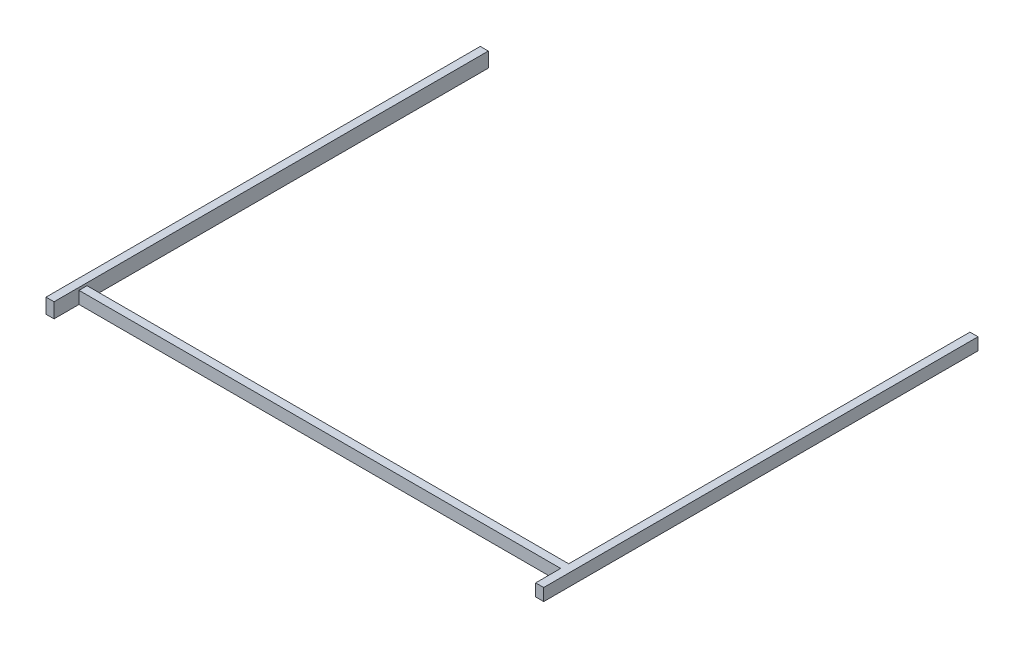
ISO-10303-21;
HEADER;
FILE_DESCRIPTION(('STEP AP214'),'2;1');
FILE_NAME('part.step','',(''),(''),'','','');
FILE_SCHEMA(('AUTOMOTIVE_DESIGN { 1 0 10303 214 1 1 1 1 }'));
ENDSEC;
DATA;
#1=APPLICATION_CONTEXT('core data for automotive mechanical design processes');
#2=APPLICATION_PROTOCOL_DEFINITION('international standard','automotive_design',2000,#1);
#3=PRODUCT_CONTEXT('',#1,'mechanical');
#4=PRODUCT('Part','Part','',(#3));
#5=PRODUCT_RELATED_PRODUCT_CATEGORY('part','',(#4));
#6=PRODUCT_DEFINITION_FORMATION('','',#4);
#7=PRODUCT_DEFINITION_CONTEXT('part definition',#1,'design');
#8=PRODUCT_DEFINITION('design','',#6,#7);
#9=PRODUCT_DEFINITION_SHAPE('','',#8);
#10=(LENGTH_UNIT() NAMED_UNIT(*) SI_UNIT(.MILLI.,.METRE.));
#11=(NAMED_UNIT(*) PLANE_ANGLE_UNIT() SI_UNIT($,.RADIAN.));
#12=(NAMED_UNIT(*) SI_UNIT($,.STERADIAN.) SOLID_ANGLE_UNIT());
#13=UNCERTAINTY_MEASURE_WITH_UNIT(LENGTH_MEASURE(1.E-05),#10,'distance_accuracy_value','');
#14=(GEOMETRIC_REPRESENTATION_CONTEXT(3) GLOBAL_UNCERTAINTY_ASSIGNED_CONTEXT((#13)) GLOBAL_UNIT_ASSIGNED_CONTEXT((#10,
#11,#12)) REPRESENTATION_CONTEXT('',''));
#15=CARTESIAN_POINT('',(0.,0.,0.));
#16=DIRECTION('',(0.,0.,1.));
#17=DIRECTION('',(1.,0.,0.));
#18=AXIS2_PLACEMENT_3D('',#15,#16,#17);
#19=CARTESIAN_POINT('',(-140349.761744046,32.3999999999991,5409.99839999998));
#20=DIRECTION('',(-1.,0.,0.));
#21=DIRECTION('',(0.,0.,1.));
#22=AXIS2_PLACEMENT_3D('',#19,#20,#21);
#23=PLANE('',#22);
#24=DIRECTION('',(0.,0.,-1.));
#25=VECTOR('',#24,1.);
#26=CARTESIAN_POINT('',(-140349.761744046,-152.400000000004,5409.99839999998));
#27=LINE('',#26,#25);
#28=CARTESIAN_POINT('',(-140349.761744046,-152.400000000004,5409.99839999998));
#29=VERTEX_POINT('',#28);
#30=CARTESIAN_POINT('',(-140349.761744046,-152.4,5098.72135253208));
#31=VERTEX_POINT('',#30);
#32=EDGE_CURVE('E209',#29,#31,#27,.T.);
#33=ORIENTED_EDGE('',*,*,#32,.T.);
#34=DIRECTION('',(0.,1.,0.));
#35=VECTOR('',#34,1.);
#36=CARTESIAN_POINT('',(-140349.761744046,0.,5098.72135253208));
#37=LINE('',#36,#35);
#38=CARTESIAN_POINT('',(-140349.761744046,0.,5098.72135253208));
#39=VERTEX_POINT('',#38);
#40=EDGE_CURVE('E207',#31,#39,#37,.T.);
#41=ORIENTED_EDGE('',*,*,#40,.T.);
#42=DIRECTION('',(0.,0.,-1.));
#43=VECTOR('',#42,1.);
#44=CARTESIAN_POINT('',(-140349.761744046,0.,5098.72135253208));
#45=LINE('',#44,#43);
#46=CARTESIAN_POINT('',(-140349.761744046,0.,4998.72135253208));
#47=VERTEX_POINT('',#46);
#48=EDGE_CURVE('E200',#39,#47,#45,.T.);
#49=ORIENTED_EDGE('',*,*,#48,.T.);
#50=DIRECTION('',(0.,-1.,0.));
#51=VECTOR('',#50,1.);
#52=CARTESIAN_POINT('',(-140349.761744046,0.,4998.72135253208));
#53=LINE('',#52,#51);
#54=CARTESIAN_POINT('',(-140349.761744046,-152.400000000004,4998.72135253208));
#55=VERTEX_POINT('',#54);
#56=EDGE_CURVE('E230',#47,#55,#53,.T.);
#57=ORIENTED_EDGE('',*,*,#56,.T.);
#58=CARTESIAN_POINT('',(-140349.761744046,-152.400000000004,0.));
#59=VERTEX_POINT('',#58);
#60=EDGE_CURVE('E77',#55,#59,#27,.T.);
#61=ORIENTED_EDGE('',*,*,#60,.T.);
#62=DIRECTION('',(0.,1.,0.));
#63=VECTOR('',#62,1.);
#64=CARTESIAN_POINT('',(-140349.761744046,32.3999999999991,0.));
#65=LINE('',#64,#63);
#66=CARTESIAN_POINT('',(-140349.761744046,32.3999999999991,0.));
#67=VERTEX_POINT('',#66);
#68=EDGE_CURVE('E227',#59,#67,#65,.T.);
#69=ORIENTED_EDGE('',*,*,#68,.T.);
#70=DIRECTION('',(0.,0.,-1.));
#71=VECTOR('',#70,1.);
#72=CARTESIAN_POINT('',(-140349.761744046,32.3999999999991,5409.99839999998));
#73=LINE('',#72,#71);
#74=CARTESIAN_POINT('',(-140349.761744046,32.3999999999991,5409.99839999998));
#75=VERTEX_POINT('',#74);
#76=EDGE_CURVE('E11',#75,#67,#73,.T.);
#77=ORIENTED_EDGE('',*,*,#76,.F.);
#78=DIRECTION('',(0.,1.,0.));
#79=VECTOR('',#78,1.);
#80=CARTESIAN_POINT('',(-140349.761744046,32.3999999999991,5409.99839999998));
#81=LINE('',#80,#79);
#82=EDGE_CURVE('E215',#29,#75,#81,.T.);
#83=ORIENTED_EDGE('',*,*,#82,.F.);
#84=EDGE_LOOP('',(#33,#41,#49,#57,#61,#69,#77,#83));
#85=FACE_BOUND('',#84,.T.);
#86=ADVANCED_FACE('F30',(#85),#23,.F.);
#87=CARTESIAN_POINT('',(-140349.761744046,32.3999999999991,5409.99839999998));
#88=DIRECTION('',(0.,-1.,0.));
#89=DIRECTION('',(1.,0.,0.));
#90=AXIS2_PLACEMENT_3D('',#87,#88,#89);
#91=PLANE('',#90);
#92=DIRECTION('',(-1.,0.,0.));
#93=VECTOR('',#92,1.);
#94=CARTESIAN_POINT('',(-140349.761744046,32.3999999999991,0.));
#95=LINE('',#94,#93);
#96=CARTESIAN_POINT('',(-140449.761744046,32.3999999999991,0.));
#97=VERTEX_POINT('',#96);
#98=EDGE_CURVE('E229',#67,#97,#95,.T.);
#99=ORIENTED_EDGE('',*,*,#98,.T.);
#100=DIRECTION('',(0.,0.,-1.));
#101=VECTOR('',#100,1.);
#102=CARTESIAN_POINT('',(-140449.761744046,32.3999999999991,5409.99839999998));
#103=LINE('',#102,#101);
#104=CARTESIAN_POINT('',(-140449.761744046,32.3999999999991,5409.99839999998));
#105=VERTEX_POINT('',#104);
#106=EDGE_CURVE('E39',#105,#97,#103,.T.);
#107=ORIENTED_EDGE('',*,*,#106,.F.);
#108=DIRECTION('',(-1.,0.,0.));
#109=VECTOR('',#108,1.);
#110=CARTESIAN_POINT('',(-140349.761744046,32.3999999999991,5409.99839999998));
#111=LINE('',#110,#109);
#112=EDGE_CURVE('E84',#75,#105,#111,.T.);
#113=ORIENTED_EDGE('',*,*,#112,.F.);
#114=ORIENTED_EDGE('',*,*,#76,.T.);
#115=EDGE_LOOP('',(#99,#107,#113,#114));
#116=FACE_BOUND('',#115,.T.);
#117=ADVANCED_FACE('F248',(#116),#91,.F.);
#118=CARTESIAN_POINT('',(-140449.761744046,32.3999999999991,5409.99839999998));
#119=DIRECTION('',(1.,0.,0.));
#120=DIRECTION('',(0.,0.,-1.));
#121=AXIS2_PLACEMENT_3D('',#118,#119,#120);
#122=PLANE('',#121);
#123=DIRECTION('',(0.,-1.,0.));
#124=VECTOR('',#123,1.);
#125=CARTESIAN_POINT('',(-140449.761744046,32.3999999999991,0.));
#126=LINE('',#125,#124);
#127=CARTESIAN_POINT('',(-140449.761744046,-152.400000000004,0.));
#128=VERTEX_POINT('',#127);
#129=EDGE_CURVE('E220',#97,#128,#126,.T.);
#130=ORIENTED_EDGE('',*,*,#129,.T.);
#131=DIRECTION('',(0.,0.,-1.));
#132=VECTOR('',#131,1.);
#133=CARTESIAN_POINT('',(-140449.761744046,-152.400000000004,5409.99839999998));
#134=LINE('',#133,#132);
#135=CARTESIAN_POINT('',(-140449.761744046,-152.400000000004,5409.99839999998));
#136=VERTEX_POINT('',#135);
#137=EDGE_CURVE('E212',#136,#128,#134,.T.);
#138=ORIENTED_EDGE('',*,*,#137,.F.);
#139=DIRECTION('',(0.,-1.,0.));
#140=VECTOR('',#139,1.);
#141=CARTESIAN_POINT('',(-140449.761744046,32.3999999999991,5409.99839999998));
#142=LINE('',#141,#140);
#143=EDGE_CURVE('E218',#105,#136,#142,.T.);
#144=ORIENTED_EDGE('',*,*,#143,.F.);
#145=ORIENTED_EDGE('',*,*,#106,.T.);
#146=EDGE_LOOP('',(#130,#138,#144,#145));
#147=FACE_BOUND('',#146,.T.);
#148=ADVANCED_FACE('F250',(#147),#122,.F.);
#149=CARTESIAN_POINT('',(-140349.761744046,-152.400000000004,5409.99839999998));
#150=DIRECTION('',(0.,1.,0.));
#151=DIRECTION('',(0.,0.,1.));
#152=AXIS2_PLACEMENT_3D('',#149,#150,#151);
#153=PLANE('',#152);
#154=DIRECTION('',(1.,0.,0.));
#155=VECTOR('',#154,1.);
#156=CARTESIAN_POINT('',(-140349.761744046,-152.400000000004,0.));
#157=LINE('',#156,#155);
#158=EDGE_CURVE('E216',#128,#59,#157,.T.);
#159=ORIENTED_EDGE('',*,*,#158,.T.);
#160=ORIENTED_EDGE('',*,*,#60,.F.);
#161=DIRECTION('',(1.,0.,0.));
#162=VECTOR('',#161,1.);
#163=CARTESIAN_POINT('',(-140532.041090106,-152.4,4998.72135253208));
#164=LINE('',#163,#162);
#165=CARTESIAN_POINT('',(-134349.761744046,-152.4,4998.72135253208));
#166=VERTEX_POINT('',#165);
#167=EDGE_CURVE('E47',#55,#166,#164,.T.);
#168=ORIENTED_EDGE('',*,*,#167,.T.);
#169=DIRECTION('',(0.,0.,-1.));
#170=VECTOR('',#169,1.);
#171=CARTESIAN_POINT('',(-134349.761744046,-152.4,5409.99839999998));
#172=LINE('',#171,#170);
#173=CARTESIAN_POINT('',(-134349.761744046,-152.4,0.));
#174=VERTEX_POINT('',#173);
#175=EDGE_CURVE('E155',#166,#174,#172,.T.);
#176=ORIENTED_EDGE('',*,*,#175,.T.);
#177=DIRECTION('',(1.,0.,0.));
#178=VECTOR('',#177,1.);
#179=CARTESIAN_POINT('',(-134349.761744046,-152.4,0.));
#180=LINE('',#179,#178);
#181=CARTESIAN_POINT('',(-134249.761744046,-152.4,0.));
#182=VERTEX_POINT('',#181);
#183=EDGE_CURVE('E185',#174,#182,#180,.T.);
#184=ORIENTED_EDGE('',*,*,#183,.T.);
#185=DIRECTION('',(0.,0.,-1.));
#186=VECTOR('',#185,1.);
#187=CARTESIAN_POINT('',(-134249.761744046,-152.4,5409.99839999998));
#188=LINE('',#187,#186);
#189=CARTESIAN_POINT('',(-134249.761744046,-152.4,5409.99839999998));
#190=VERTEX_POINT('',#189);
#191=EDGE_CURVE('E138',#190,#182,#188,.T.);
#192=ORIENTED_EDGE('',*,*,#191,.F.);
#193=DIRECTION('',(1.,0.,0.));
#194=VECTOR('',#193,1.);
#195=CARTESIAN_POINT('',(-134349.761744046,-152.4,5409.99839999998));
#196=LINE('',#195,#194);
#197=CARTESIAN_POINT('',(-134349.761744046,-152.4,5409.99839999998));
#198=VERTEX_POINT('',#197);
#199=EDGE_CURVE('E131',#198,#190,#196,.T.);
#200=ORIENTED_EDGE('',*,*,#199,.F.);
#201=CARTESIAN_POINT('',(-134349.761744046,-152.4,5098.72135253208));
#202=VERTEX_POINT('',#201);
#203=EDGE_CURVE('E135',#198,#202,#172,.T.);
#204=ORIENTED_EDGE('',*,*,#203,.T.);
#205=DIRECTION('',(1.,0.,0.));
#206=VECTOR('',#205,1.);
#207=CARTESIAN_POINT('',(-140532.041090106,-152.4,5098.72135253208));
#208=LINE('',#207,#206);
#209=EDGE_CURVE('E154',#31,#202,#208,.T.);
#210=ORIENTED_EDGE('',*,*,#209,.F.);
#211=ORIENTED_EDGE('',*,*,#32,.F.);
#212=DIRECTION('',(1.,0.,0.));
#213=VECTOR('',#212,1.);
#214=CARTESIAN_POINT('',(-140349.761744046,-152.400000000004,5409.99839999998));
#215=LINE('',#214,#213);
#216=EDGE_CURVE('E56',#136,#29,#215,.T.);
#217=ORIENTED_EDGE('',*,*,#216,.F.);
#218=ORIENTED_EDGE('',*,*,#137,.T.);
#219=EDGE_LOOP('',(#159,#160,#168,#176,#184,#192,#200,#204,#210,#211,#217,#218));
#220=FACE_BOUND('',#219,.T.);
#221=ADVANCED_FACE('F133',(#220),#153,.F.);
#222=CARTESIAN_POINT('',(-140349.761744046,-152.400000000004,5409.99839999998));
#223=DIRECTION('',(0.,0.,-1.));
#224=DIRECTION('',(-1.,0.,0.));
#225=AXIS2_PLACEMENT_3D('',#222,#223,#224);
#226=PLANE('',#225);
#227=ORIENTED_EDGE('',*,*,#82,.T.);
#228=ORIENTED_EDGE('',*,*,#112,.T.);
#229=ORIENTED_EDGE('',*,*,#143,.T.);
#230=ORIENTED_EDGE('',*,*,#216,.T.);
#231=EDGE_LOOP('',(#227,#228,#229,#230));
#232=FACE_BOUND('',#231,.T.);
#233=ADVANCED_FACE('F259',(#232),#226,.F.);
#234=CARTESIAN_POINT('',(-140349.761744046,-152.400000000004,0.));
#235=DIRECTION('',(0.,0.,-1.));
#236=DIRECTION('',(-1.,0.,0.));
#237=AXIS2_PLACEMENT_3D('',#234,#235,#236);
#238=PLANE('',#237);
#239=ORIENTED_EDGE('',*,*,#68,.F.);
#240=ORIENTED_EDGE('',*,*,#158,.F.);
#241=ORIENTED_EDGE('',*,*,#129,.F.);
#242=ORIENTED_EDGE('',*,*,#98,.F.);
#243=EDGE_LOOP('',(#239,#240,#241,#242));
#244=FACE_BOUND('',#243,.T.);
#245=ADVANCED_FACE('F247',(#244),#238,.T.);
#246=CARTESIAN_POINT('',(-140532.041090106,0.,5098.72135253208));
#247=DIRECTION('',(0.,0.,-1.));
#248=DIRECTION('',(-1.,0.,0.));
#249=AXIS2_PLACEMENT_3D('',#246,#247,#248);
#250=PLANE('',#249);
#251=ORIENTED_EDGE('',*,*,#40,.F.);
#252=ORIENTED_EDGE('',*,*,#209,.T.);
#253=DIRECTION('',(0.,1.,0.));
#254=VECTOR('',#253,1.);
#255=CARTESIAN_POINT('',(-134349.761744046,0.,5098.72135253208));
#256=LINE('',#255,#254);
#257=CARTESIAN_POINT('',(-134349.761744046,0.,5098.72135253208));
#258=VERTEX_POINT('',#257);
#259=EDGE_CURVE('E33',#202,#258,#256,.T.);
#260=ORIENTED_EDGE('',*,*,#259,.T.);
#261=DIRECTION('',(1.,0.,0.));
#262=VECTOR('',#261,1.);
#263=CARTESIAN_POINT('',(-140532.041090106,0.,5098.72135253208));
#264=LINE('',#263,#262);
#265=EDGE_CURVE('E197',#39,#258,#264,.T.);
#266=ORIENTED_EDGE('',*,*,#265,.F.);
#267=EDGE_LOOP('',(#251,#252,#260,#266));
#268=FACE_BOUND('',#267,.T.);
#269=ADVANCED_FACE('F206',(#268),#250,.F.);
#270=CARTESIAN_POINT('',(-140532.041090106,0.,5098.72135253208));
#271=DIRECTION('',(0.,-1.,0.));
#272=DIRECTION('',(0.,0.,-1.));
#273=AXIS2_PLACEMENT_3D('',#270,#271,#272);
#274=PLANE('',#273);
#275=ORIENTED_EDGE('',*,*,#48,.F.);
#276=ORIENTED_EDGE('',*,*,#265,.T.);
#277=DIRECTION('',(0.,0.,-1.));
#278=VECTOR('',#277,1.);
#279=CARTESIAN_POINT('',(-134349.761744046,0.,5409.99839999998));
#280=LINE('',#279,#278);
#281=CARTESIAN_POINT('',(-134349.761744046,0.,5409.99839999998));
#282=VERTEX_POINT('',#281);
#283=EDGE_CURVE('E163',#282,#258,#280,.T.);
#284=ORIENTED_EDGE('',*,*,#283,.F.);
#285=DIRECTION('',(-1.,0.,0.));
#286=VECTOR('',#285,1.);
#287=CARTESIAN_POINT('',(-134349.761744046,0.,5409.99839999998));
#288=LINE('',#287,#286);
#289=CARTESIAN_POINT('',(-134249.761744046,0.,5409.99839999998));
#290=VERTEX_POINT('',#289);
#291=EDGE_CURVE('E147',#290,#282,#288,.T.);
#292=ORIENTED_EDGE('',*,*,#291,.F.);
#293=DIRECTION('',(0.,0.,-1.));
#294=VECTOR('',#293,1.);
#295=CARTESIAN_POINT('',(-134249.761744046,0.,5409.99839999998));
#296=LINE('',#295,#294);
#297=CARTESIAN_POINT('',(-134249.761744046,0.,0.));
#298=VERTEX_POINT('',#297);
#299=EDGE_CURVE('E166',#290,#298,#296,.T.);
#300=ORIENTED_EDGE('',*,*,#299,.T.);
#301=DIRECTION('',(-1.,0.,0.));
#302=VECTOR('',#301,1.);
#303=CARTESIAN_POINT('',(-134349.761744046,0.,0.));
#304=LINE('',#303,#302);
#305=CARTESIAN_POINT('',(-134349.761744046,0.,0.));
#306=VERTEX_POINT('',#305);
#307=EDGE_CURVE('E150',#298,#306,#304,.T.);
#308=ORIENTED_EDGE('',*,*,#307,.T.);
#309=CARTESIAN_POINT('',(-134349.761744046,0.,4998.72135253208));
#310=VERTEX_POINT('',#309);
#311=EDGE_CURVE('E167',#310,#306,#280,.T.);
#312=ORIENTED_EDGE('',*,*,#311,.F.);
#313=DIRECTION('',(1.,0.,0.));
#314=VECTOR('',#313,1.);
#315=CARTESIAN_POINT('',(-140532.041090106,0.,4998.72135253208));
#316=LINE('',#315,#314);
#317=EDGE_CURVE('E204',#47,#310,#316,.T.);
#318=ORIENTED_EDGE('',*,*,#317,.F.);
#319=EDGE_LOOP('',(#275,#276,#284,#292,#300,#308,#312,#318));
#320=FACE_BOUND('',#319,.T.);
#321=ADVANCED_FACE('F194',(#320),#274,.F.);
#322=CARTESIAN_POINT('',(-140532.041090106,0.,4998.72135253208));
#323=DIRECTION('',(0.,0.,1.));
#324=DIRECTION('',(1.,0.,0.));
#325=AXIS2_PLACEMENT_3D('',#322,#323,#324);
#326=PLANE('',#325);
#327=ORIENTED_EDGE('',*,*,#56,.F.);
#328=ORIENTED_EDGE('',*,*,#317,.T.);
#329=DIRECTION('',(0.,-1.,0.));
#330=VECTOR('',#329,1.);
#331=CARTESIAN_POINT('',(-134349.761744046,0.,4998.72135253208));
#332=LINE('',#331,#330);
#333=EDGE_CURVE('E372',#310,#166,#332,.T.);
#334=ORIENTED_EDGE('',*,*,#333,.T.);
#335=ORIENTED_EDGE('',*,*,#167,.F.);
#336=EDGE_LOOP('',(#327,#328,#334,#335));
#337=FACE_BOUND('',#336,.T.);
#338=ADVANCED_FACE('F268',(#337),#326,.F.);
#339=CARTESIAN_POINT('',(-134349.761744046,0.,5409.99839999998));
#340=DIRECTION('',(1.,0.,0.));
#341=DIRECTION('',(0.,0.,-1.));
#342=AXIS2_PLACEMENT_3D('',#339,#340,#341);
#343=PLANE('',#342);
#344=ORIENTED_EDGE('',*,*,#259,.F.);
#345=ORIENTED_EDGE('',*,*,#203,.F.);
#346=DIRECTION('',(0.,-1.,0.));
#347=VECTOR('',#346,1.);
#348=CARTESIAN_POINT('',(-134349.761744046,0.,5409.99839999998));
#349=LINE('',#348,#347);
#350=EDGE_CURVE('E142',#282,#198,#349,.T.);
#351=ORIENTED_EDGE('',*,*,#350,.F.);
#352=ORIENTED_EDGE('',*,*,#283,.T.);
#353=EDGE_LOOP('',(#344,#345,#351,#352));
#354=FACE_BOUND('',#353,.T.);
#355=ADVANCED_FACE('F152',(#354),#343,.F.);
#356=ORIENTED_EDGE('',*,*,#333,.F.);
#357=ORIENTED_EDGE('',*,*,#311,.T.);
#358=DIRECTION('',(0.,-1.,0.));
#359=VECTOR('',#358,1.);
#360=CARTESIAN_POINT('',(-134349.761744046,0.,0.));
#361=LINE('',#360,#359);
#362=EDGE_CURVE('E188',#306,#174,#361,.T.);
#363=ORIENTED_EDGE('',*,*,#362,.T.);
#364=ORIENTED_EDGE('',*,*,#175,.F.);
#365=EDGE_LOOP('',(#356,#357,#363,#364));
#366=FACE_BOUND('',#365,.T.);
#367=ADVANCED_FACE('F271',(#366),#343,.F.);
#368=CARTESIAN_POINT('',(-134249.761744046,0.,5409.99839999998));
#369=DIRECTION('',(-1.,0.,0.));
#370=DIRECTION('',(0.,0.,1.));
#371=AXIS2_PLACEMENT_3D('',#368,#369,#370);
#372=PLANE('',#371);
#373=DIRECTION('',(0.,1.,0.));
#374=VECTOR('',#373,1.);
#375=CARTESIAN_POINT('',(-134249.761744046,0.,0.));
#376=LINE('',#375,#374);
#377=EDGE_CURVE('E179',#182,#298,#376,.T.);
#378=ORIENTED_EDGE('',*,*,#377,.T.);
#379=ORIENTED_EDGE('',*,*,#299,.F.);
#380=DIRECTION('',(0.,1.,0.));
#381=VECTOR('',#380,1.);
#382=CARTESIAN_POINT('',(-134249.761744046,0.,5409.99839999998));
#383=LINE('',#382,#381);
#384=EDGE_CURVE('E141',#190,#290,#383,.T.);
#385=ORIENTED_EDGE('',*,*,#384,.F.);
#386=ORIENTED_EDGE('',*,*,#191,.T.);
#387=EDGE_LOOP('',(#378,#379,#385,#386));
#388=FACE_BOUND('',#387,.T.);
#389=ADVANCED_FACE('F177',(#388),#372,.F.);
#390=CARTESIAN_POINT('',(-134349.761744046,-152.4,5409.99839999998));
#391=DIRECTION('',(0.,0.,1.));
#392=DIRECTION('',(1.,0.,0.));
#393=AXIS2_PLACEMENT_3D('',#390,#391,#392);
#394=PLANE('',#393);
#395=ORIENTED_EDGE('',*,*,#350,.T.);
#396=ORIENTED_EDGE('',*,*,#199,.T.);
#397=ORIENTED_EDGE('',*,*,#384,.T.);
#398=ORIENTED_EDGE('',*,*,#291,.T.);
#399=EDGE_LOOP('',(#395,#396,#397,#398));
#400=FACE_BOUND('',#399,.T.);
#401=ADVANCED_FACE('F145',(#400),#394,.T.);
#402=CARTESIAN_POINT('',(-134349.761744046,-152.4,0.));
#403=DIRECTION('',(0.,0.,1.));
#404=DIRECTION('',(1.,0.,0.));
#405=AXIS2_PLACEMENT_3D('',#402,#403,#404);
#406=PLANE('',#405);
#407=ORIENTED_EDGE('',*,*,#362,.F.);
#408=ORIENTED_EDGE('',*,*,#307,.F.);
#409=ORIENTED_EDGE('',*,*,#377,.F.);
#410=ORIENTED_EDGE('',*,*,#183,.F.);
#411=EDGE_LOOP('',(#407,#408,#409,#410));
#412=FACE_BOUND('',#411,.T.);
#413=ADVANCED_FACE('F184',(#412),#406,.F.);
#414=CLOSED_SHELL('',(#86,#117,#148,#221,#233,#245,#269,#321,#338,#355,#367,#389,#401,#413));
#415=MANIFOLD_SOLID_BREP('B2',#414);
#416=ADVANCED_BREP_SHAPE_REPRESENTATION('',(#18,#415),#14);
#417=SHAPE_DEFINITION_REPRESENTATION(#9,#416);
ENDSEC;
END-ISO-10303-21;
